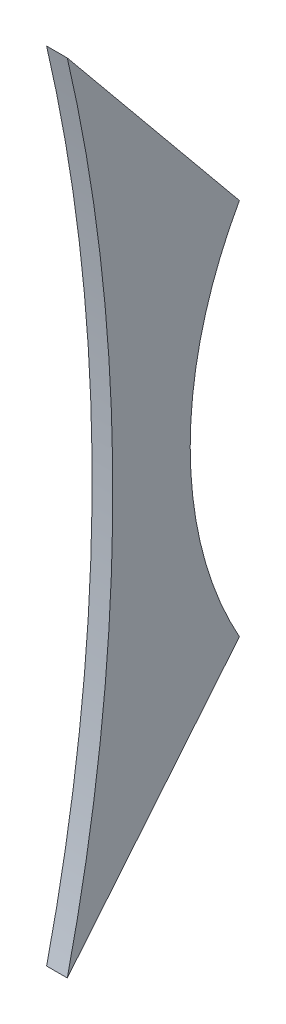
ISO-10303-21;
HEADER;
FILE_DESCRIPTION(('STEP AP214'),'2;1');
FILE_NAME('part.step','',(''),(''),'','','');
FILE_SCHEMA(('AUTOMOTIVE_DESIGN { 1 0 10303 214 1 1 1 1 }'));
ENDSEC;
DATA;
#1=APPLICATION_CONTEXT('core data for automotive mechanical design processes');
#2=APPLICATION_PROTOCOL_DEFINITION('international standard','automotive_design',2000,#1);
#3=PRODUCT_CONTEXT('',#1,'mechanical');
#4=PRODUCT('Part','Part','',(#3));
#5=PRODUCT_RELATED_PRODUCT_CATEGORY('part','',(#4));
#6=PRODUCT_DEFINITION_FORMATION('','',#4);
#7=PRODUCT_DEFINITION_CONTEXT('part definition',#1,'design');
#8=PRODUCT_DEFINITION('design','',#6,#7);
#9=PRODUCT_DEFINITION_SHAPE('','',#8);
#10=(LENGTH_UNIT() NAMED_UNIT(*) SI_UNIT(.MILLI.,.METRE.));
#11=(NAMED_UNIT(*) PLANE_ANGLE_UNIT() SI_UNIT($,.RADIAN.));
#12=(NAMED_UNIT(*) SI_UNIT($,.STERADIAN.) SOLID_ANGLE_UNIT());
#13=UNCERTAINTY_MEASURE_WITH_UNIT(LENGTH_MEASURE(1.E-05),#10,'distance_accuracy_value','');
#14=(GEOMETRIC_REPRESENTATION_CONTEXT(3) GLOBAL_UNCERTAINTY_ASSIGNED_CONTEXT((#13)) GLOBAL_UNIT_ASSIGNED_CONTEXT((#10,
#11,#12)) REPRESENTATION_CONTEXT('',''));
#15=CARTESIAN_POINT('',(0.,0.,0.));
#16=DIRECTION('',(0.,0.,1.));
#17=DIRECTION('',(1.,0.,0.));
#18=AXIS2_PLACEMENT_3D('',#15,#16,#17);
#19=CARTESIAN_POINT('',(0.,330.49999999312,-120.230191256596));
#20=DIRECTION('',(1.,0.,0.));
#21=DIRECTION('',(0.,1.,0.));
#22=AXIS2_PLACEMENT_3D('',#19,#20,#21);
#23=PLANE('',#22);
#24=CARTESIAN_POINT('',(0.,330.499999818758,1354.57360227975));
#25=DIRECTION('',(-1.,0.,0.));
#26=DIRECTION('',(0.,0.225607260391102,0.974218334901793));
#27=AXIS2_PLACEMENT_3D('',#24,#25,#26);
#28=CIRCLE('',#27,1451.6376812302);
#29=CARTESIAN_POINT('',(0.,658.000000512924,-59.638442327674));
#30=VERTEX_POINT('',#29);
#31=CARTESIAN_POINT('',(0.,2.9999994759203,-59.6384424090337));
#32=VERTEX_POINT('',#31);
#33=EDGE_CURVE('E26',#30,#32,#28,.T.);
#34=ORIENTED_EDGE('',*,*,#33,.F.);
#35=DIRECTION('',(0.,0.772716959072579,0.634750739394312));
#36=VECTOR('',#35,1.);
#37=CARTESIAN_POINT('',(0.,485.774324553814,-201.113757285091));
#38=LINE('',#37,#36);
#39=CARTESIAN_POINT('',(0.,485.774324553814,-201.113757285091));
#40=VERTEX_POINT('',#39);
#41=EDGE_CURVE('E89',#40,#30,#38,.T.);
#42=ORIENTED_EDGE('',*,*,#41,.F.);
#43=CARTESIAN_POINT('',(0.,330.500000130056,-479.009336316708));
#44=DIRECTION('',(-1.,0.,0.));
#45=DIRECTION('',(0.,-0.487772849022908,-0.872970588139186));
#46=AXIS2_PLACEMENT_3D('',#43,#44,#45);
#47=CIRCLE('',#46,318.333266672794);
#48=CARTESIAN_POINT('',(0.,175.225675510536,-201.113757394473));
#49=VERTEX_POINT('',#48);
#50=EDGE_CURVE('E77',#49,#40,#47,.T.);
#51=ORIENTED_EDGE('',*,*,#50,.F.);
#52=DIRECTION('',(0.,0.772716959147403,-0.634750739303225));
#53=VECTOR('',#52,1.);
#54=CARTESIAN_POINT('',(0.,2.99999947592031,-59.6384424090337));
#55=LINE('',#54,#53);
#56=EDGE_CURVE('E62',#32,#49,#55,.T.);
#57=ORIENTED_EDGE('',*,*,#56,.F.);
#58=EDGE_LOOP('',(#34,#42,#51,#57));
#59=FACE_BOUND('',#58,.T.);
#60=ADVANCED_FACE('F16',(#59),#23,.F.);
#61=CARTESIAN_POINT('',(17.,330.49999999312,-120.230191256596));
#62=DIRECTION('',(1.,0.,0.));
#63=DIRECTION('',(0.,1.,0.));
#64=AXIS2_PLACEMENT_3D('',#61,#62,#63);
#65=PLANE('',#64);
#66=CARTESIAN_POINT('',(17.,330.499999818758,1354.57360227975));
#67=DIRECTION('',(-1.,0.,0.));
#68=DIRECTION('',(0.,0.225607260391102,0.974218334901793));
#69=AXIS2_PLACEMENT_3D('',#66,#67,#68);
#70=CIRCLE('',#69,1451.6376812302);
#71=CARTESIAN_POINT('',(17.,658.000000512924,-59.638442327674));
#72=VERTEX_POINT('',#71);
#73=CARTESIAN_POINT('',(17.,2.99999947592028,-59.6384424090337));
#74=VERTEX_POINT('',#73);
#75=EDGE_CURVE('E11',#72,#74,#70,.T.);
#76=ORIENTED_EDGE('',*,*,#75,.T.);
#77=DIRECTION('',(0.,0.772716959147403,-0.634750739303225));
#78=VECTOR('',#77,1.);
#79=CARTESIAN_POINT('',(17.,2.99999947592031,-59.6384424090337));
#80=LINE('',#79,#78);
#81=CARTESIAN_POINT('',(17.,175.225675510536,-201.113757394473));
#82=VERTEX_POINT('',#81);
#83=EDGE_CURVE('E51',#74,#82,#80,.T.);
#84=ORIENTED_EDGE('',*,*,#83,.T.);
#85=CARTESIAN_POINT('',(17.,330.500000130056,-479.009336316708));
#86=DIRECTION('',(-1.,0.,0.));
#87=DIRECTION('',(0.,-0.487772849022908,-0.872970588139186));
#88=AXIS2_PLACEMENT_3D('',#85,#86,#87);
#89=CIRCLE('',#88,318.333266672794);
#90=CARTESIAN_POINT('',(17.,485.774324553814,-201.113757285091));
#91=VERTEX_POINT('',#90);
#92=EDGE_CURVE('E84',#82,#91,#89,.T.);
#93=ORIENTED_EDGE('',*,*,#92,.T.);
#94=DIRECTION('',(0.,0.772716959072579,0.634750739394312));
#95=VECTOR('',#94,1.);
#96=CARTESIAN_POINT('',(17.,485.774324553814,-201.113757285091));
#97=LINE('',#96,#95);
#98=EDGE_CURVE('E90',#91,#72,#97,.T.);
#99=ORIENTED_EDGE('',*,*,#98,.T.);
#100=EDGE_LOOP('',(#76,#84,#93,#99));
#101=FACE_BOUND('',#100,.T.);
#102=ADVANCED_FACE('F121',(#101),#65,.T.);
#103=CARTESIAN_POINT('',(0.,330.499999818758,1354.57360227975));
#104=DIRECTION('',(1.,0.,0.));
#105=DIRECTION('',(0.,0.225607260391102,0.974218334901793));
#106=AXIS2_PLACEMENT_3D('',#103,#104,#105);
#107=CYLINDRICAL_SURFACE('',#106,1451.6376812302);
#108=ORIENTED_EDGE('',*,*,#33,.T.);
#109=DIRECTION('',(1.,0.,0.));
#110=VECTOR('',#109,1.);
#111=CARTESIAN_POINT('',(0.,2.9999994759203,-59.6384424090337));
#112=LINE('',#111,#110);
#113=EDGE_CURVE('E112',#32,#74,#112,.T.);
#114=ORIENTED_EDGE('',*,*,#113,.T.);
#115=ORIENTED_EDGE('',*,*,#75,.F.);
#116=DIRECTION('',(1.,0.,0.));
#117=VECTOR('',#116,1.);
#118=CARTESIAN_POINT('',(0.,658.000000512924,-59.638442327674));
#119=LINE('',#118,#117);
#120=EDGE_CURVE('E94',#30,#72,#119,.T.);
#121=ORIENTED_EDGE('',*,*,#120,.F.);
#122=EDGE_LOOP('',(#108,#114,#115,#121));
#123=FACE_BOUND('',#122,.T.);
#124=ADVANCED_FACE('F119',(#123),#107,.F.);
#125=CARTESIAN_POINT('',(0.,2.99999947592031,-59.6384424090337));
#126=DIRECTION('',(0.,-0.634750739303225,-0.772716959147403));
#127=DIRECTION('',(0.,-0.772716959147403,0.634750739303225));
#128=AXIS2_PLACEMENT_3D('',#125,#126,#127);
#129=PLANE('',#128);
#130=ORIENTED_EDGE('',*,*,#56,.T.);
#131=DIRECTION('',(1.,0.,0.));
#132=VECTOR('',#131,1.);
#133=CARTESIAN_POINT('',(0.,175.225675510536,-201.113757394473));
#134=LINE('',#133,#132);
#135=EDGE_CURVE('E82',#49,#82,#134,.T.);
#136=ORIENTED_EDGE('',*,*,#135,.T.);
#137=ORIENTED_EDGE('',*,*,#83,.F.);
#138=ORIENTED_EDGE('',*,*,#113,.F.);
#139=EDGE_LOOP('',(#130,#136,#137,#138));
#140=FACE_BOUND('',#139,.T.);
#141=ADVANCED_FACE('F120',(#140),#129,.T.);
#142=CARTESIAN_POINT('',(0.,330.500000130056,-479.009336316708));
#143=DIRECTION('',(1.,0.,0.));
#144=DIRECTION('',(0.,-0.487772849022908,-0.872970588139186));
#145=AXIS2_PLACEMENT_3D('',#142,#143,#144);
#146=CYLINDRICAL_SURFACE('',#145,318.333266672794);
#147=ORIENTED_EDGE('',*,*,#50,.T.);
#148=DIRECTION('',(1.,0.,0.));
#149=VECTOR('',#148,1.);
#150=CARTESIAN_POINT('',(0.,485.774324553814,-201.113757285091));
#151=LINE('',#150,#149);
#152=EDGE_CURVE('E80',#40,#91,#151,.T.);
#153=ORIENTED_EDGE('',*,*,#152,.T.);
#154=ORIENTED_EDGE('',*,*,#92,.F.);
#155=ORIENTED_EDGE('',*,*,#135,.F.);
#156=EDGE_LOOP('',(#147,#153,#154,#155));
#157=FACE_BOUND('',#156,.T.);
#158=ADVANCED_FACE('F18',(#157),#146,.F.);
#159=CARTESIAN_POINT('',(0.,485.774324553814,-201.113757285091));
#160=DIRECTION('',(0.,0.634750739394312,-0.772716959072579));
#161=DIRECTION('',(-1.,0.,0.));
#162=AXIS2_PLACEMENT_3D('',#159,#160,#161);
#163=PLANE('',#162);
#164=ORIENTED_EDGE('',*,*,#41,.T.);
#165=ORIENTED_EDGE('',*,*,#120,.T.);
#166=ORIENTED_EDGE('',*,*,#98,.F.);
#167=ORIENTED_EDGE('',*,*,#152,.F.);
#168=EDGE_LOOP('',(#164,#165,#166,#167));
#169=FACE_BOUND('',#168,.T.);
#170=ADVANCED_FACE('F87',(#169),#163,.T.);
#171=CLOSED_SHELL('',(#60,#102,#124,#141,#158,#170));
#172=MANIFOLD_SOLID_BREP('B1',#171);
#173=ADVANCED_BREP_SHAPE_REPRESENTATION('',(#18,#172),#14);
#174=SHAPE_DEFINITION_REPRESENTATION(#9,#173);
ENDSEC;
END-ISO-10303-21;
